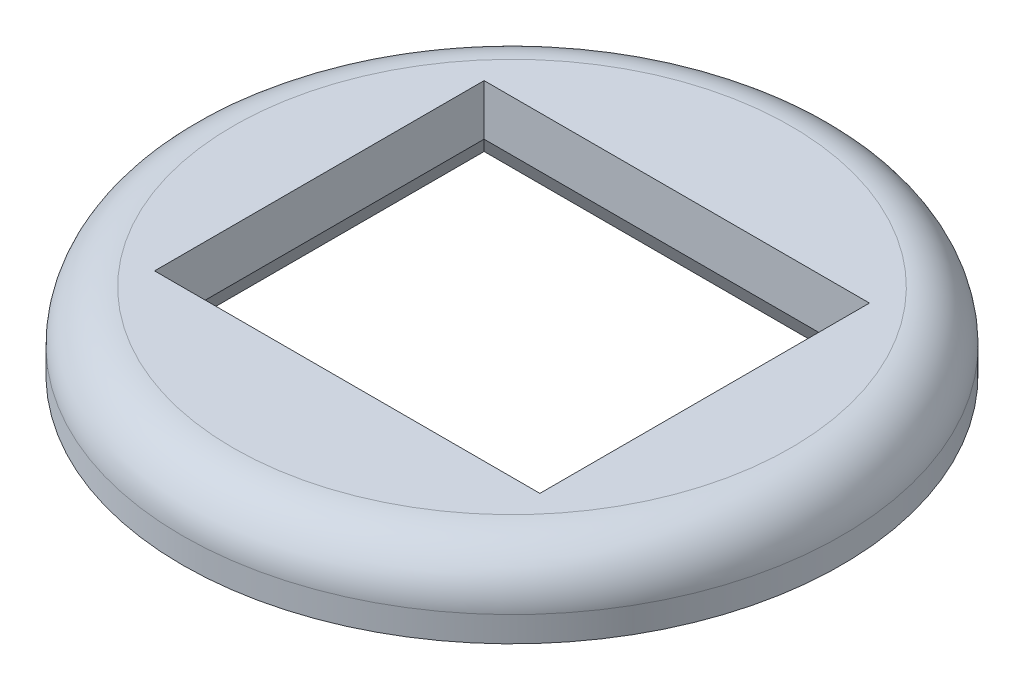
ISO-10303-21;
HEADER;
FILE_DESCRIPTION(('STEP AP214'),'2;1');
FILE_NAME('part.step','',(''),(''),'','','');
FILE_SCHEMA(('AUTOMOTIVE_DESIGN { 1 0 10303 214 1 1 1 1 }'));
ENDSEC;
DATA;
#1=APPLICATION_CONTEXT('core data for automotive mechanical design processes');
#2=APPLICATION_PROTOCOL_DEFINITION('international standard','automotive_design',2000,#1);
#3=PRODUCT_CONTEXT('',#1,'mechanical');
#4=PRODUCT('Part','Part','',(#3));
#5=PRODUCT_RELATED_PRODUCT_CATEGORY('part','',(#4));
#6=PRODUCT_DEFINITION_FORMATION('','',#4);
#7=PRODUCT_DEFINITION_CONTEXT('part definition',#1,'design');
#8=PRODUCT_DEFINITION('design','',#6,#7);
#9=PRODUCT_DEFINITION_SHAPE('','',#8);
#10=(LENGTH_UNIT() NAMED_UNIT(*) SI_UNIT(.MILLI.,.METRE.));
#11=(NAMED_UNIT(*) PLANE_ANGLE_UNIT() SI_UNIT($,.RADIAN.));
#12=(NAMED_UNIT(*) SI_UNIT($,.STERADIAN.) SOLID_ANGLE_UNIT());
#13=UNCERTAINTY_MEASURE_WITH_UNIT(LENGTH_MEASURE(1.E-05),#10,'distance_accuracy_value','');
#14=(GEOMETRIC_REPRESENTATION_CONTEXT(3) GLOBAL_UNCERTAINTY_ASSIGNED_CONTEXT((#13)) GLOBAL_UNIT_ASSIGNED_CONTEXT((#10,
#11,#12)) REPRESENTATION_CONTEXT('',''));
#15=CARTESIAN_POINT('',(0.,0.,0.));
#16=DIRECTION('',(0.,0.,1.));
#17=DIRECTION('',(1.,0.,0.));
#18=AXIS2_PLACEMENT_3D('',#15,#16,#17);
#19=CARTESIAN_POINT('',(0.,3.,0.));
#20=DIRECTION('',(0.,1.,0.));
#21=DIRECTION('',(0.,0.,1.));
#22=AXIS2_PLACEMENT_3D('',#19,#20,#21);
#23=PLANE('',#22);
#24=CARTESIAN_POINT('',(0.,3.,0.));
#25=DIRECTION('',(0.,1.,0.));
#26=DIRECTION('',(0.,0.,1.));
#27=AXIS2_PLACEMENT_3D('',#24,#25,#26);
#28=CIRCLE('',#27,11.);
#29=CARTESIAN_POINT('',(0.,3.,11.));
#30=VERTEX_POINT('',#29);
#31=EDGE_CURVE('E121',#30,#30,#28,.T.);
#32=ORIENTED_EDGE('',*,*,#31,.T.);
#33=EDGE_LOOP('',(#32));
#34=FACE_BOUND('',#33,.T.);
#35=DIRECTION('',(1.,0.,0.));
#36=VECTOR('',#35,1.);
#37=CARTESIAN_POINT('',(7.6,3.,6.5));
#38=LINE('',#37,#36);
#39=CARTESIAN_POINT('',(-7.6,3.,6.5));
#40=VERTEX_POINT('',#39);
#41=CARTESIAN_POINT('',(7.6,3.,6.5));
#42=VERTEX_POINT('',#41);
#43=EDGE_CURVE('E99',#40,#42,#38,.T.);
#44=ORIENTED_EDGE('',*,*,#43,.F.);
#45=DIRECTION('',(0.,0.,1.));
#46=VECTOR('',#45,1.);
#47=CARTESIAN_POINT('',(-7.6,3.,6.5));
#48=LINE('',#47,#46);
#49=CARTESIAN_POINT('',(-7.6,3.,-6.5));
#50=VERTEX_POINT('',#49);
#51=EDGE_CURVE('E92',#50,#40,#48,.T.);
#52=ORIENTED_EDGE('',*,*,#51,.F.);
#53=DIRECTION('',(-1.,0.,0.));
#54=VECTOR('',#53,1.);
#55=CARTESIAN_POINT('',(7.6,3.,-6.5));
#56=LINE('',#55,#54);
#57=CARTESIAN_POINT('',(7.6,3.,-6.5));
#58=VERTEX_POINT('',#57);
#59=EDGE_CURVE('E110',#58,#50,#56,.T.);
#60=ORIENTED_EDGE('',*,*,#59,.F.);
#61=DIRECTION('',(0.,0.,-1.));
#62=VECTOR('',#61,1.);
#63=CARTESIAN_POINT('',(7.6,3.,6.5));
#64=LINE('',#63,#62);
#65=EDGE_CURVE('E108',#42,#58,#64,.T.);
#66=ORIENTED_EDGE('',*,*,#65,.F.);
#67=EDGE_LOOP('',(#44,#52,#60,#66));
#68=FACE_BOUND('',#67,.T.);
#69=ADVANCED_FACE('F38',(#34,#68),#23,.T.);
#70=CARTESIAN_POINT('',(0.,0.,0.));
#71=DIRECTION('',(0.,1.,0.));
#72=DIRECTION('',(0.,0.,1.));
#73=AXIS2_PLACEMENT_3D('',#70,#71,#72);
#74=PLANE('',#73);
#75=DIRECTION('',(1.,0.,0.));
#76=VECTOR('',#75,1.);
#77=CARTESIAN_POINT('',(7.6,0.,7.07735026918962));
#78=LINE('',#77,#76);
#79=CARTESIAN_POINT('',(-8.17735026918962,0.,7.07735026918962));
#80=VERTEX_POINT('',#79);
#81=CARTESIAN_POINT('',(8.17735026918962,0.,7.07735026918962));
#82=VERTEX_POINT('',#81);
#83=EDGE_CURVE('E131',#80,#82,#78,.T.);
#84=ORIENTED_EDGE('',*,*,#83,.T.);
#85=DIRECTION('',(0.,0.,-1.));
#86=VECTOR('',#85,1.);
#87=CARTESIAN_POINT('',(8.17735026918962,0.,-6.5));
#88=LINE('',#87,#86);
#89=CARTESIAN_POINT('',(8.17735026918962,0.,-7.07735026918962));
#90=VERTEX_POINT('',#89);
#91=EDGE_CURVE('E133',#82,#90,#88,.T.);
#92=ORIENTED_EDGE('',*,*,#91,.T.);
#93=DIRECTION('',(-1.,0.,0.));
#94=VECTOR('',#93,1.);
#95=CARTESIAN_POINT('',(-7.6,0.,-7.07735026918962));
#96=LINE('',#95,#94);
#97=CARTESIAN_POINT('',(-8.17735026918962,0.,-7.07735026918962));
#98=VERTEX_POINT('',#97);
#99=EDGE_CURVE('E127',#90,#98,#96,.T.);
#100=ORIENTED_EDGE('',*,*,#99,.T.);
#101=DIRECTION('',(0.,0.,1.));
#102=VECTOR('',#101,1.);
#103=CARTESIAN_POINT('',(-8.17735026918962,0.,6.5));
#104=LINE('',#103,#102);
#105=EDGE_CURVE('E129',#98,#80,#104,.T.);
#106=ORIENTED_EDGE('',*,*,#105,.T.);
#107=EDGE_LOOP('',(#84,#92,#100,#106));
#108=FACE_BOUND('',#107,.T.);
#109=CARTESIAN_POINT('',(0.,0.,0.));
#110=DIRECTION('',(0.,1.,0.));
#111=DIRECTION('',(0.,0.,1.));
#112=AXIS2_PLACEMENT_3D('',#109,#110,#111);
#113=CIRCLE('',#112,13.);
#114=CARTESIAN_POINT('',(0.,0.,13.));
#115=VERTEX_POINT('',#114);
#116=EDGE_CURVE('E103',#115,#115,#113,.T.);
#117=ORIENTED_EDGE('',*,*,#116,.F.);
#118=EDGE_LOOP('',(#117));
#119=FACE_BOUND('',#118,.T.);
#120=ADVANCED_FACE('F169',(#108,#119),#74,.F.);
#121=CARTESIAN_POINT('',(0.,3.,0.));
#122=DIRECTION('',(0.,-1.,0.));
#123=DIRECTION('',(0.,0.,-1.));
#124=AXIS2_PLACEMENT_3D('',#121,#122,#123);
#125=CYLINDRICAL_SURFACE('',#124,13.);
#126=CARTESIAN_POINT('',(0.,1.,0.));
#127=DIRECTION('',(0.,1.,0.));
#128=DIRECTION('',(0.,0.,1.));
#129=AXIS2_PLACEMENT_3D('',#126,#127,#128);
#130=CIRCLE('',#129,13.);
#131=CARTESIAN_POINT('',(0.,1.,13.));
#132=VERTEX_POINT('',#131);
#133=EDGE_CURVE('E124',#132,#132,#130,.F.);
#134=ORIENTED_EDGE('',*,*,#133,.T.);
#135=EDGE_LOOP('',(#134));
#136=FACE_BOUND('',#135,.T.);
#137=ORIENTED_EDGE('',*,*,#116,.T.);
#138=EDGE_LOOP('',(#137));
#139=FACE_BOUND('',#138,.T.);
#140=ADVANCED_FACE('F172',(#136,#139),#125,.T.);
#141=CARTESIAN_POINT('',(-7.6,3.,6.5));
#142=DIRECTION('',(1.,0.,0.));
#143=DIRECTION('',(0.,0.,-1.));
#144=AXIS2_PLACEMENT_3D('',#141,#142,#143);
#145=PLANE('',#144);
#146=DIRECTION('',(0.,-1.,0.));
#147=VECTOR('',#146,1.);
#148=CARTESIAN_POINT('',(-7.6,3.,6.5));
#149=LINE('',#148,#147);
#150=CARTESIAN_POINT('',(-7.6,1.,6.5));
#151=VERTEX_POINT('',#150);
#152=EDGE_CURVE('E94',#40,#151,#149,.T.);
#153=ORIENTED_EDGE('',*,*,#152,.T.);
#154=DIRECTION('',(0.,0.,-1.));
#155=VECTOR('',#154,1.);
#156=CARTESIAN_POINT('',(-7.6,1.,-6.5));
#157=LINE('',#156,#155);
#158=CARTESIAN_POINT('',(-7.6,1.,-6.5));
#159=VERTEX_POINT('',#158);
#160=EDGE_CURVE('E47',#151,#159,#157,.T.);
#161=ORIENTED_EDGE('',*,*,#160,.T.);
#162=DIRECTION('',(0.,-1.,0.));
#163=VECTOR('',#162,1.);
#164=CARTESIAN_POINT('',(-7.6,3.,-6.5));
#165=LINE('',#164,#163);
#166=EDGE_CURVE('E95',#50,#159,#165,.T.);
#167=ORIENTED_EDGE('',*,*,#166,.F.);
#168=ORIENTED_EDGE('',*,*,#51,.T.);
#169=EDGE_LOOP('',(#153,#161,#167,#168));
#170=FACE_BOUND('',#169,.T.);
#171=ADVANCED_FACE('F93',(#170),#145,.T.);
#172=CARTESIAN_POINT('',(7.6,3.,6.5));
#173=DIRECTION('',(0.,0.,-1.));
#174=DIRECTION('',(-1.,0.,0.));
#175=AXIS2_PLACEMENT_3D('',#172,#173,#174);
#176=PLANE('',#175);
#177=DIRECTION('',(0.,-1.,0.));
#178=VECTOR('',#177,1.);
#179=CARTESIAN_POINT('',(7.6,3.,6.5));
#180=LINE('',#179,#178);
#181=CARTESIAN_POINT('',(7.6,1.,6.5));
#182=VERTEX_POINT('',#181);
#183=EDGE_CURVE('E104',#42,#182,#180,.T.);
#184=ORIENTED_EDGE('',*,*,#183,.T.);
#185=DIRECTION('',(-1.,0.,0.));
#186=VECTOR('',#185,1.);
#187=CARTESIAN_POINT('',(-7.6,1.,6.5));
#188=LINE('',#187,#186);
#189=EDGE_CURVE('E62',#182,#151,#188,.T.);
#190=ORIENTED_EDGE('',*,*,#189,.T.);
#191=ORIENTED_EDGE('',*,*,#152,.F.);
#192=ORIENTED_EDGE('',*,*,#43,.T.);
#193=EDGE_LOOP('',(#184,#190,#191,#192));
#194=FACE_BOUND('',#193,.T.);
#195=ADVANCED_FACE('F101',(#194),#176,.T.);
#196=CARTESIAN_POINT('',(7.6,3.,6.5));
#197=DIRECTION('',(-1.,0.,0.));
#198=DIRECTION('',(0.,0.,1.));
#199=AXIS2_PLACEMENT_3D('',#196,#197,#198);
#200=PLANE('',#199);
#201=DIRECTION('',(0.,-1.,0.));
#202=VECTOR('',#201,1.);
#203=CARTESIAN_POINT('',(7.6,3.,-6.5));
#204=LINE('',#203,#202);
#205=CARTESIAN_POINT('',(7.6,1.,-6.5));
#206=VERTEX_POINT('',#205);
#207=EDGE_CURVE('E115',#58,#206,#204,.T.);
#208=ORIENTED_EDGE('',*,*,#207,.T.);
#209=DIRECTION('',(0.,0.,1.));
#210=VECTOR('',#209,1.);
#211=CARTESIAN_POINT('',(7.6,1.,6.5));
#212=LINE('',#211,#210);
#213=EDGE_CURVE('E136',#206,#182,#212,.T.);
#214=ORIENTED_EDGE('',*,*,#213,.T.);
#215=ORIENTED_EDGE('',*,*,#183,.F.);
#216=ORIENTED_EDGE('',*,*,#65,.T.);
#217=EDGE_LOOP('',(#208,#214,#215,#216));
#218=FACE_BOUND('',#217,.T.);
#219=ADVANCED_FACE('F164',(#218),#200,.T.);
#220=CARTESIAN_POINT('',(7.6,3.,-6.5));
#221=DIRECTION('',(0.,0.,1.));
#222=DIRECTION('',(1.,0.,0.));
#223=AXIS2_PLACEMENT_3D('',#220,#221,#222);
#224=PLANE('',#223);
#225=ORIENTED_EDGE('',*,*,#166,.T.);
#226=DIRECTION('',(1.,0.,0.));
#227=VECTOR('',#226,1.);
#228=CARTESIAN_POINT('',(7.6,1.,-6.5));
#229=LINE('',#228,#227);
#230=EDGE_CURVE('E11',#159,#206,#229,.T.);
#231=ORIENTED_EDGE('',*,*,#230,.T.);
#232=ORIENTED_EDGE('',*,*,#207,.F.);
#233=ORIENTED_EDGE('',*,*,#59,.T.);
#234=EDGE_LOOP('',(#225,#231,#232,#233));
#235=FACE_BOUND('',#234,.T.);
#236=ADVANCED_FACE('F161',(#235),#224,.T.);
#237=CARTESIAN_POINT('',(0.,1.,0.));
#238=DIRECTION('',(0.,1.,0.));
#239=DIRECTION('',(0.,0.,1.));
#240=AXIS2_PLACEMENT_3D('',#237,#238,#239);
#241=TOROIDAL_SURFACE('',#240,11.,2.);
#242=ORIENTED_EDGE('',*,*,#133,.F.);
#243=EDGE_LOOP('',(#242));
#244=FACE_BOUND('',#243,.T.);
#245=ORIENTED_EDGE('',*,*,#31,.F.);
#246=EDGE_LOOP('',(#245));
#247=FACE_BOUND('',#246,.T.);
#248=ADVANCED_FACE('F195',(#244,#247),#241,.T.);
#249=CARTESIAN_POINT('',(-8.17735026918962,0.,0.));
#250=DIRECTION('',(0.86602540378444,-0.499999999999998,0.));
#251=DIRECTION('',(0.,0.,-1.));
#252=AXIS2_PLACEMENT_3D('',#249,#250,#251);
#253=PLANE('',#252);
#254=DIRECTION('',(-0.447213595499956,-0.774596669241485,-0.447213595499956));
#255=VECTOR('',#254,1.);
#256=CARTESIAN_POINT('',(-6.76188021535171,2.45166604983954,-5.66188021535171));
#257=LINE('',#256,#255);
#258=EDGE_CURVE('E144',#159,#98,#257,.T.);
#259=ORIENTED_EDGE('',*,*,#258,.F.);
#260=ORIENTED_EDGE('',*,*,#160,.F.);
#261=DIRECTION('',(-0.447213595499956,-0.774596669241485,0.447213595499956));
#262=VECTOR('',#261,1.);
#263=CARTESIAN_POINT('',(-6.54188021535171,2.83271722750469,5.44188021535171));
#264=LINE('',#263,#262);
#265=EDGE_CURVE('E42',#80,#151,#264,.F.);
#266=ORIENTED_EDGE('',*,*,#265,.F.);
#267=ORIENTED_EDGE('',*,*,#105,.F.);
#268=EDGE_LOOP('',(#259,#260,#266,#267));
#269=FACE_BOUND('',#268,.T.);
#270=ADVANCED_FACE('F40',(#269),#253,.T.);
#271=CARTESIAN_POINT('',(0.,0.,7.07735026918962));
#272=DIRECTION('',(0.,-0.499999999999998,-0.86602540378444));
#273=DIRECTION('',(-1.,0.,0.));
#274=AXIS2_PLACEMENT_3D('',#271,#272,#273);
#275=PLANE('',#274);
#276=ORIENTED_EDGE('',*,*,#265,.T.);
#277=ORIENTED_EDGE('',*,*,#189,.F.);
#278=DIRECTION('',(0.447213595499957,-0.774596669241485,0.447213595499956));
#279=VECTOR('',#278,1.);
#280=CARTESIAN_POINT('',(6.76188021535171,2.45166604983953,5.66188021535171));
#281=LINE('',#280,#279);
#282=EDGE_CURVE('E143',#82,#182,#281,.F.);
#283=ORIENTED_EDGE('',*,*,#282,.F.);
#284=ORIENTED_EDGE('',*,*,#83,.F.);
#285=EDGE_LOOP('',(#276,#277,#283,#284));
#286=FACE_BOUND('',#285,.T.);
#287=ADVANCED_FACE('F154',(#286),#275,.T.);
#288=CARTESIAN_POINT('',(0.,0.,-7.07735026918962));
#289=DIRECTION('',(0.,-0.499999999999998,0.86602540378444));
#290=DIRECTION('',(1.,0.,0.));
#291=AXIS2_PLACEMENT_3D('',#288,#289,#290);
#292=PLANE('',#291);
#293=ORIENTED_EDGE('',*,*,#258,.T.);
#294=ORIENTED_EDGE('',*,*,#99,.F.);
#295=DIRECTION('',(-0.447213595499957,0.774596669241485,0.447213595499956));
#296=VECTOR('',#295,1.);
#297=CARTESIAN_POINT('',(6.76188021535171,2.45166604983954,-5.66188021535171));
#298=LINE('',#297,#296);
#299=EDGE_CURVE('E141',#206,#90,#298,.F.);
#300=ORIENTED_EDGE('',*,*,#299,.F.);
#301=ORIENTED_EDGE('',*,*,#230,.F.);
#302=EDGE_LOOP('',(#293,#294,#300,#301));
#303=FACE_BOUND('',#302,.T.);
#304=ADVANCED_FACE('F159',(#303),#292,.T.);
#305=CARTESIAN_POINT('',(8.17735026918962,0.,0.));
#306=DIRECTION('',(-0.866025403784439,-0.499999999999998,0.));
#307=DIRECTION('',(0.,0.,1.));
#308=AXIS2_PLACEMENT_3D('',#305,#306,#307);
#309=PLANE('',#308);
#310=ORIENTED_EDGE('',*,*,#282,.T.);
#311=ORIENTED_EDGE('',*,*,#213,.F.);
#312=ORIENTED_EDGE('',*,*,#299,.T.);
#313=ORIENTED_EDGE('',*,*,#91,.F.);
#314=EDGE_LOOP('',(#310,#311,#312,#313));
#315=FACE_BOUND('',#314,.T.);
#316=ADVANCED_FACE('F166',(#315),#309,.T.);
#317=CLOSED_SHELL('',(#69,#120,#140,#171,#195,#219,#236,#248,#270,#287,#304,#316));
#318=MANIFOLD_SOLID_BREP('B2',#317);
#319=ADVANCED_BREP_SHAPE_REPRESENTATION('',(#18,#318),#14);
#320=SHAPE_DEFINITION_REPRESENTATION(#9,#319);
ENDSEC;
END-ISO-10303-21;
